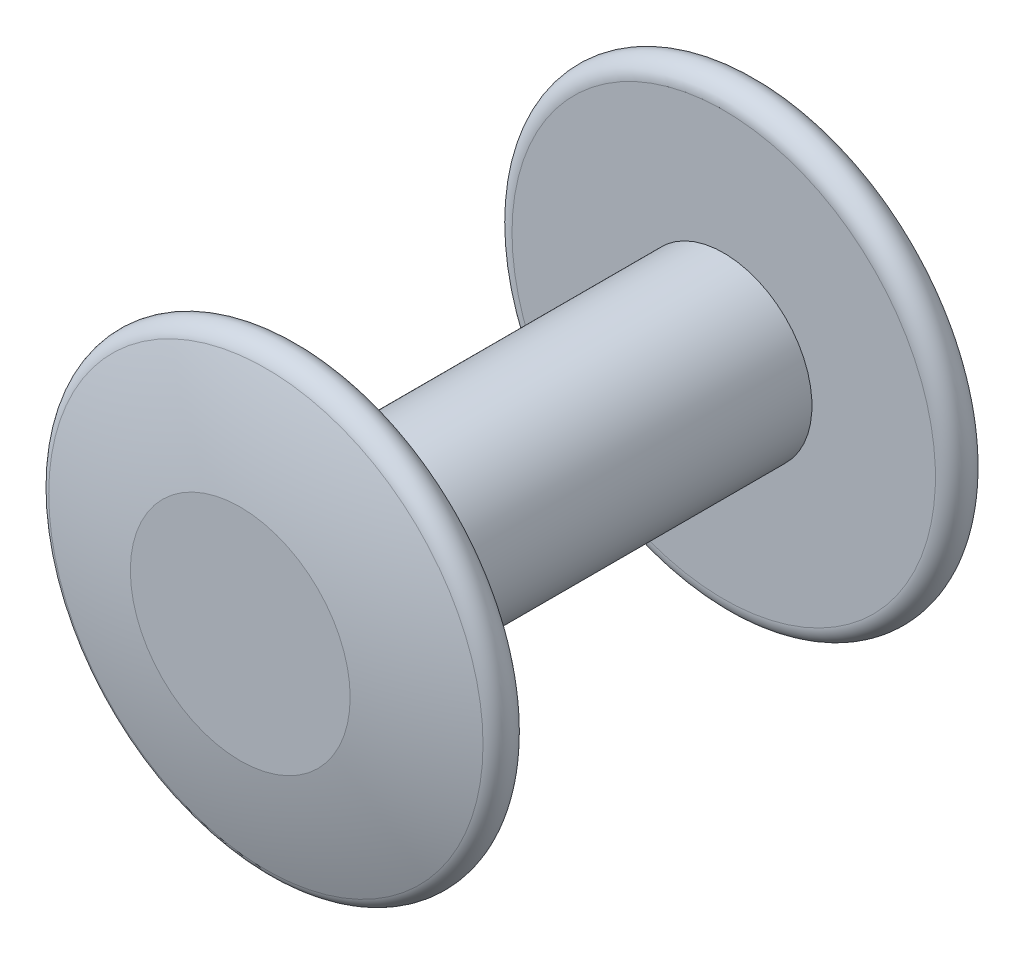
ISO-10303-21;
HEADER;
FILE_DESCRIPTION(('STEP AP214'),'2;1');
FILE_NAME('part.step','',(''),(''),'','','');
FILE_SCHEMA(('AUTOMOTIVE_DESIGN { 1 0 10303 214 1 1 1 1 }'));
ENDSEC;
DATA;
#1=APPLICATION_CONTEXT('core data for automotive mechanical design processes');
#2=APPLICATION_PROTOCOL_DEFINITION('international standard','automotive_design',2000,#1);
#3=PRODUCT_CONTEXT('',#1,'mechanical');
#4=PRODUCT('Part','Part','',(#3));
#5=PRODUCT_RELATED_PRODUCT_CATEGORY('part','',(#4));
#6=PRODUCT_DEFINITION_FORMATION('','',#4);
#7=PRODUCT_DEFINITION_CONTEXT('part definition',#1,'design');
#8=PRODUCT_DEFINITION('design','',#6,#7);
#9=PRODUCT_DEFINITION_SHAPE('','',#8);
#10=(LENGTH_UNIT() NAMED_UNIT(*) SI_UNIT(.MILLI.,.METRE.));
#11=(NAMED_UNIT(*) PLANE_ANGLE_UNIT() SI_UNIT($,.RADIAN.));
#12=(NAMED_UNIT(*) SI_UNIT($,.STERADIAN.) SOLID_ANGLE_UNIT());
#13=UNCERTAINTY_MEASURE_WITH_UNIT(LENGTH_MEASURE(1.E-05),#10,'distance_accuracy_value','');
#14=(GEOMETRIC_REPRESENTATION_CONTEXT(3) GLOBAL_UNCERTAINTY_ASSIGNED_CONTEXT((#13)) GLOBAL_UNIT_ASSIGNED_CONTEXT((#10,
#11,#12)) REPRESENTATION_CONTEXT('',''));
#15=CARTESIAN_POINT('',(0.,0.,0.));
#16=DIRECTION('',(0.,0.,1.));
#17=DIRECTION('',(1.,0.,0.));
#18=AXIS2_PLACEMENT_3D('',#15,#16,#17);
#19=CARTESIAN_POINT('',(0.,0.,6.5));
#20=DIRECTION('',(0.,0.,-1.));
#21=DIRECTION('',(-1.,0.,0.));
#22=AXIS2_PLACEMENT_3D('',#19,#20,#21);
#23=TOROIDAL_SURFACE('',#22,6.,0.500000000000003);
#24=CARTESIAN_POINT('',(0.,0.,6.));
#25=DIRECTION('',(0.,0.,-1.));
#26=DIRECTION('',(-1.,0.,0.));
#27=AXIS2_PLACEMENT_3D('',#24,#25,#26);
#28=CIRCLE('',#27,6.);
#29=CARTESIAN_POINT('',(-6.,0.,6.));
#30=VERTEX_POINT('',#29);
#31=EDGE_CURVE('E53',#30,#30,#28,.T.);
#32=ORIENTED_EDGE('',*,*,#31,.F.);
#33=EDGE_LOOP('',(#32));
#34=FACE_BOUND('',#33,.T.);
#35=CARTESIAN_POINT('',(0.,0.,6.97574295680204));
#36=DIRECTION('',(0.,0.,-1.));
#37=DIRECTION('',(-1.,0.,0.));
#38=AXIS2_PLACEMENT_3D('',#35,#36,#37);
#39=CIRCLE('',#38,6.15384615384616);
#40=CARTESIAN_POINT('',(-6.15384615384616,0.,6.97574295680204));
#41=VERTEX_POINT('',#40);
#42=EDGE_CURVE('E9',#41,#41,#39,.T.);
#43=ORIENTED_EDGE('',*,*,#42,.T.);
#44=EDGE_LOOP('',(#43));
#45=FACE_BOUND('',#44,.T.);
#46=ADVANCED_FACE('F13',(#34,#45),#23,.T.);
#47=CARTESIAN_POINT('',(0.,0.,-12.0539753152795));
#48=DIRECTION('',(0.,0.,-1.));
#49=DIRECTION('',(0.,1.,0.));
#50=AXIS2_PLACEMENT_3D('',#47,#48,#49);
#51=SPHERICAL_SURFACE('',#50,20.);
#52=ORIENTED_EDGE('',*,*,#42,.F.);
#53=EDGE_LOOP('',(#52));
#54=FACE_BOUND('',#53,.T.);
#55=CARTESIAN_POINT('',(0.,0.,7.70196512603628));
#56=DIRECTION('',(0.,0.,-1.));
#57=DIRECTION('',(-1.,0.,0.));
#58=AXIS2_PLACEMENT_3D('',#55,#56,#57);
#59=CIRCLE('',#58,3.11493455455888);
#60=CARTESIAN_POINT('',(-3.11493455455888,0.,7.70196512603628));
#61=VERTEX_POINT('',#60);
#62=EDGE_CURVE('E20',#61,#61,#59,.T.);
#63=ORIENTED_EDGE('',*,*,#62,.T.);
#64=EDGE_LOOP('',(#63));
#65=FACE_BOUND('',#64,.T.);
#66=ADVANCED_FACE('F63',(#54,#65),#51,.T.);
#67=CARTESIAN_POINT('',(0.,0.,7.70196512603628));
#68=DIRECTION('',(0.,0.,1.));
#69=DIRECTION('',(1.,0.,0.));
#70=AXIS2_PLACEMENT_3D('',#67,#68,#69);
#71=PLANE('',#70);
#72=ORIENTED_EDGE('',*,*,#62,.F.);
#73=EDGE_LOOP('',(#72));
#74=FACE_BOUND('',#73,.T.);
#75=ADVANCED_FACE('F68',(#74),#71,.T.);
#76=CARTESIAN_POINT('',(0.,0.,-7.70196512603628));
#77=DIRECTION('',(0.,0.,-1.));
#78=DIRECTION('',(-1.,0.,0.));
#79=AXIS2_PLACEMENT_3D('',#76,#77,#78);
#80=PLANE('',#79);
#81=CARTESIAN_POINT('',(0.,0.,-7.70196512603628));
#82=DIRECTION('',(0.,0.,-1.));
#83=DIRECTION('',(-1.,0.,0.));
#84=AXIS2_PLACEMENT_3D('',#81,#82,#83);
#85=CIRCLE('',#84,3.11493455455888);
#86=CARTESIAN_POINT('',(-3.11493455455888,0.,-7.70196512603628));
#87=VERTEX_POINT('',#86);
#88=EDGE_CURVE('E28',#87,#87,#85,.T.);
#89=ORIENTED_EDGE('',*,*,#88,.T.);
#90=EDGE_LOOP('',(#89));
#91=FACE_BOUND('',#90,.T.);
#92=ADVANCED_FACE('F73',(#91),#80,.T.);
#93=CARTESIAN_POINT('',(0.,0.,12.0539753152795));
#94=DIRECTION('',(0.,0.,-1.));
#95=DIRECTION('',(0.,1.,0.));
#96=AXIS2_PLACEMENT_3D('',#93,#94,#95);
#97=SPHERICAL_SURFACE('',#96,20.);
#98=CARTESIAN_POINT('',(0.,0.,-6.97574295680204));
#99=DIRECTION('',(0.,0.,-1.));
#100=DIRECTION('',(-1.,0.,0.));
#101=AXIS2_PLACEMENT_3D('',#98,#99,#100);
#102=CIRCLE('',#101,6.15384615384616);
#103=CARTESIAN_POINT('',(-6.15384615384616,0.,-6.97574295680204));
#104=VERTEX_POINT('',#103);
#105=EDGE_CURVE('E35',#104,#104,#102,.T.);
#106=ORIENTED_EDGE('',*,*,#105,.T.);
#107=EDGE_LOOP('',(#106));
#108=FACE_BOUND('',#107,.T.);
#109=ORIENTED_EDGE('',*,*,#88,.F.);
#110=EDGE_LOOP('',(#109));
#111=FACE_BOUND('',#110,.T.);
#112=ADVANCED_FACE('F79',(#108,#111),#97,.T.);
#113=CARTESIAN_POINT('',(0.,0.,-6.5));
#114=DIRECTION('',(0.,0.,-1.));
#115=DIRECTION('',(-1.,0.,0.));
#116=AXIS2_PLACEMENT_3D('',#113,#114,#115);
#117=TOROIDAL_SURFACE('',#116,6.,0.500000000000003);
#118=CARTESIAN_POINT('',(0.,0.,-6.));
#119=DIRECTION('',(0.,0.,-1.));
#120=DIRECTION('',(-1.,0.,0.));
#121=AXIS2_PLACEMENT_3D('',#118,#119,#120);
#122=CIRCLE('',#121,6.);
#123=CARTESIAN_POINT('',(-6.,0.,-6.));
#124=VERTEX_POINT('',#123);
#125=EDGE_CURVE('E41',#124,#124,#122,.T.);
#126=ORIENTED_EDGE('',*,*,#125,.T.);
#127=EDGE_LOOP('',(#126));
#128=FACE_BOUND('',#127,.T.);
#129=ORIENTED_EDGE('',*,*,#105,.F.);
#130=EDGE_LOOP('',(#129));
#131=FACE_BOUND('',#130,.T.);
#132=ADVANCED_FACE('F83',(#128,#131),#117,.T.);
#133=CARTESIAN_POINT('',(0.,0.,-6.));
#134=DIRECTION('',(0.,0.,1.));
#135=DIRECTION('',(1.,0.,0.));
#136=AXIS2_PLACEMENT_3D('',#133,#134,#135);
#137=PLANE('',#136);
#138=CARTESIAN_POINT('',(0.,0.,-6.));
#139=DIRECTION('',(0.,0.,-1.));
#140=DIRECTION('',(-1.,0.,0.));
#141=AXIS2_PLACEMENT_3D('',#138,#139,#140);
#142=CIRCLE('',#141,2.5);
#143=CARTESIAN_POINT('',(-2.5,0.,-6.));
#144=VERTEX_POINT('',#143);
#145=EDGE_CURVE('E45',#144,#144,#142,.T.);
#146=ORIENTED_EDGE('',*,*,#145,.T.);
#147=EDGE_LOOP('',(#146));
#148=FACE_BOUND('',#147,.T.);
#149=ORIENTED_EDGE('',*,*,#125,.F.);
#150=EDGE_LOOP('',(#149));
#151=FACE_BOUND('',#150,.T.);
#152=ADVANCED_FACE('F87',(#148,#151),#137,.T.);
#153=CARTESIAN_POINT('',(0.,0.,-7.94602468472053));
#154=DIRECTION('',(0.,0.,-1.));
#155=DIRECTION('',(-1.,0.,0.));
#156=AXIS2_PLACEMENT_3D('',#153,#154,#155);
#157=CYLINDRICAL_SURFACE('',#156,2.5);
#158=ORIENTED_EDGE('',*,*,#145,.F.);
#159=EDGE_LOOP('',(#158));
#160=FACE_BOUND('',#159,.T.);
#161=CARTESIAN_POINT('',(0.,0.,6.));
#162=DIRECTION('',(0.,0.,-1.));
#163=DIRECTION('',(-1.,0.,0.));
#164=AXIS2_PLACEMENT_3D('',#161,#162,#163);
#165=CIRCLE('',#164,2.5);
#166=CARTESIAN_POINT('',(-2.5,0.,6.));
#167=VERTEX_POINT('',#166);
#168=EDGE_CURVE('E49',#167,#167,#165,.T.);
#169=ORIENTED_EDGE('',*,*,#168,.T.);
#170=EDGE_LOOP('',(#169));
#171=FACE_BOUND('',#170,.T.);
#172=ADVANCED_FACE('F91',(#160,#171),#157,.T.);
#173=CARTESIAN_POINT('',(0.,0.,6.));
#174=DIRECTION('',(0.,0.,1.));
#175=DIRECTION('',(1.,0.,0.));
#176=AXIS2_PLACEMENT_3D('',#173,#174,#175);
#177=PLANE('',#176);
#178=ORIENTED_EDGE('',*,*,#168,.F.);
#179=EDGE_LOOP('',(#178));
#180=FACE_BOUND('',#179,.T.);
#181=ORIENTED_EDGE('',*,*,#31,.T.);
#182=EDGE_LOOP('',(#181));
#183=FACE_BOUND('',#182,.T.);
#184=ADVANCED_FACE('F60',(#180,#183),#177,.F.);
#185=CLOSED_SHELL('',(#46,#66,#75,#92,#112,#132,#152,#172,#184));
#186=MANIFOLD_SOLID_BREP('B1',#185);
#187=ADVANCED_BREP_SHAPE_REPRESENTATION('',(#18,#186),#14);
#188=SHAPE_DEFINITION_REPRESENTATION(#9,#187);
ENDSEC;
END-ISO-10303-21;
